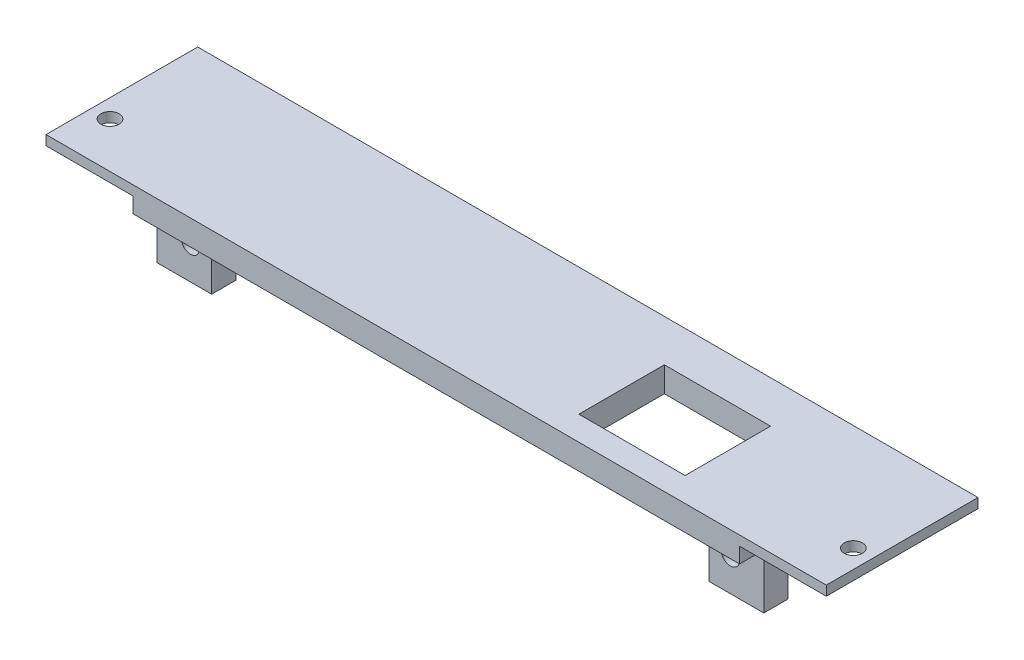
ISO-10303-21;
HEADER;
FILE_DESCRIPTION(('STEP AP214'),'2;1');
FILE_NAME('part.step','',(''),(''),'','','');
FILE_SCHEMA(('AUTOMOTIVE_DESIGN { 1 0 10303 214 1 1 1 1 }'));
ENDSEC;
DATA;
#1=APPLICATION_CONTEXT('core data for automotive mechanical design processes');
#2=APPLICATION_PROTOCOL_DEFINITION('international standard','automotive_design',2000,#1);
#3=PRODUCT_CONTEXT('',#1,'mechanical');
#4=PRODUCT('Part','Part','',(#3));
#5=PRODUCT_RELATED_PRODUCT_CATEGORY('part','',(#4));
#6=PRODUCT_DEFINITION_FORMATION('','',#4);
#7=PRODUCT_DEFINITION_CONTEXT('part definition',#1,'design');
#8=PRODUCT_DEFINITION('design','',#6,#7);
#9=PRODUCT_DEFINITION_SHAPE('','',#8);
#10=(LENGTH_UNIT() NAMED_UNIT(*) SI_UNIT(.MILLI.,.METRE.));
#11=(NAMED_UNIT(*) PLANE_ANGLE_UNIT() SI_UNIT($,.RADIAN.));
#12=(NAMED_UNIT(*) SI_UNIT($,.STERADIAN.) SOLID_ANGLE_UNIT());
#13=UNCERTAINTY_MEASURE_WITH_UNIT(LENGTH_MEASURE(1.E-05),#10,'distance_accuracy_value','');
#14=(GEOMETRIC_REPRESENTATION_CONTEXT(3) GLOBAL_UNCERTAINTY_ASSIGNED_CONTEXT((#13)) GLOBAL_UNIT_ASSIGNED_CONTEXT((#10,
#11,#12)) REPRESENTATION_CONTEXT('',''));
#15=CARTESIAN_POINT('',(0.,0.,0.));
#16=DIRECTION('',(0.,0.,1.));
#17=DIRECTION('',(1.,0.,0.));
#18=AXIS2_PLACEMENT_3D('',#15,#16,#17);
#19=CARTESIAN_POINT('',(0.,-2.54,0.));
#20=DIRECTION('',(0.,1.,0.));
#21=DIRECTION('',(0.,0.,1.));
#22=AXIS2_PLACEMENT_3D('',#19,#20,#21);
#23=PLANE('',#22);
#24=DIRECTION('',(-1.,0.,0.));
#25=VECTOR('',#24,1.);
#26=CARTESIAN_POINT('',(19.517706015329,-2.54,-5.59079221502232));
#27=LINE('',#26,#25);
#28=CARTESIAN_POINT('',(37.025706015329,-2.54,-5.59079221502232));
#29=VERTEX_POINT('',#28);
#30=CARTESIAN_POINT('',(19.517706015329,-2.54,-5.59079221502232));
#31=VERTEX_POINT('',#30);
#32=EDGE_CURVE('E261',#29,#31,#27,.T.);
#33=ORIENTED_EDGE('',*,*,#32,.T.);
#34=DIRECTION('',(0.,0.,1.));
#35=VECTOR('',#34,1.);
#36=CARTESIAN_POINT('',(19.517706015329,-2.54,-5.59079221502232));
#37=LINE('',#36,#35);
#38=CARTESIAN_POINT('',(19.517706015329,-2.54,8.49999999999975));
#39=VERTEX_POINT('',#38);
#40=EDGE_CURVE('E249',#31,#39,#37,.T.);
#41=ORIENTED_EDGE('',*,*,#40,.T.);
#42=DIRECTION('',(1.,0.,0.));
#43=VECTOR('',#42,1.);
#44=CARTESIAN_POINT('',(19.517706015329,-2.54,8.49999999999975));
#45=LINE('',#44,#43);
#46=CARTESIAN_POINT('',(37.025706015329,-2.54,8.49999999999975));
#47=VERTEX_POINT('',#46);
#48=EDGE_CURVE('E255',#39,#47,#45,.T.);
#49=ORIENTED_EDGE('',*,*,#48,.T.);
#50=DIRECTION('',(0.,0.,-1.));
#51=VECTOR('',#50,1.);
#52=CARTESIAN_POINT('',(37.025706015329,-2.54,-5.59079221502232));
#53=LINE('',#52,#51);
#54=EDGE_CURVE('E258',#47,#29,#53,.T.);
#55=ORIENTED_EDGE('',*,*,#54,.T.);
#56=EDGE_LOOP('',(#33,#41,#49,#55));
#57=FACE_BOUND('',#56,.T.);
#58=DIRECTION('',(0.,0.,1.));
#59=VECTOR('',#58,1.);
#60=CARTESIAN_POINT('',(-41.,-2.54,4.5));
#61=LINE('',#60,#59);
#62=CARTESIAN_POINT('',(-41.,-2.54,2.5));
#63=VERTEX_POINT('',#62);
#64=CARTESIAN_POINT('',(-41.,-2.54,8.5));
#65=VERTEX_POINT('',#64);
#66=EDGE_CURVE('E247',#63,#65,#61,.T.);
#67=ORIENTED_EDGE('',*,*,#66,.F.);
#68=DIRECTION('',(-1.,0.,0.));
#69=VECTOR('',#68,1.);
#70=CARTESIAN_POINT('',(-50.,-2.54,2.5));
#71=LINE('',#70,#69);
#72=CARTESIAN_POINT('',(-50.,-2.54,2.5));
#73=VERTEX_POINT('',#72);
#74=EDGE_CURVE('E358',#63,#73,#71,.T.);
#75=ORIENTED_EDGE('',*,*,#74,.T.);
#76=DIRECTION('',(0.,0.,1.));
#77=VECTOR('',#76,1.);
#78=CARTESIAN_POINT('',(-50.,-2.54,-12.5));
#79=LINE('',#78,#77);
#80=CARTESIAN_POINT('',(-50.,-2.54,-12.5));
#81=VERTEX_POINT('',#80);
#82=EDGE_CURVE('E265',#81,#73,#79,.T.);
#83=ORIENTED_EDGE('',*,*,#82,.F.);
#84=DIRECTION('',(-1.,0.,0.));
#85=VECTOR('',#84,1.);
#86=CARTESIAN_POINT('',(-50.,-2.54,-12.5));
#87=LINE('',#86,#85);
#88=CARTESIAN_POINT('',(50.,-2.54,-12.5));
#89=VERTEX_POINT('',#88);
#90=EDGE_CURVE('E276',#89,#81,#87,.T.);
#91=ORIENTED_EDGE('',*,*,#90,.F.);
#92=DIRECTION('',(0.,0.,-1.));
#93=VECTOR('',#92,1.);
#94=CARTESIAN_POINT('',(50.,-2.54,-12.5));
#95=LINE('',#94,#93);
#96=CARTESIAN_POINT('',(50.,-2.54,2.5));
#97=VERTEX_POINT('',#96);
#98=EDGE_CURVE('E272',#97,#89,#95,.T.);
#99=ORIENTED_EDGE('',*,*,#98,.F.);
#100=DIRECTION('',(-1.,0.,0.));
#101=VECTOR('',#100,1.);
#102=CARTESIAN_POINT('',(0.,-2.54,2.5));
#103=LINE('',#102,#101);
#104=CARTESIAN_POINT('',(41.,-2.54,2.5));
#105=VERTEX_POINT('',#104);
#106=EDGE_CURVE('E355',#97,#105,#103,.T.);
#107=ORIENTED_EDGE('',*,*,#106,.T.);
#108=DIRECTION('',(0.,0.,1.));
#109=VECTOR('',#108,1.);
#110=CARTESIAN_POINT('',(41.,-2.54,4.5));
#111=LINE('',#110,#109);
#112=CARTESIAN_POINT('',(41.,-2.54,8.5));
#113=VERTEX_POINT('',#112);
#114=EDGE_CURVE('E202',#105,#113,#111,.T.);
#115=ORIENTED_EDGE('',*,*,#114,.T.);
#116=DIRECTION('',(-1.,0.,0.));
#117=VECTOR('',#116,1.);
#118=CARTESIAN_POINT('',(50.,-2.54,8.5));
#119=LINE('',#118,#117);
#120=CARTESIAN_POINT('',(50.,-2.54,8.5));
#121=VERTEX_POINT('',#120);
#122=EDGE_CURVE('E212',#121,#113,#119,.T.);
#123=ORIENTED_EDGE('',*,*,#122,.F.);
#124=CARTESIAN_POINT('',(50.,-2.54,12.5));
#125=VERTEX_POINT('',#124);
#126=EDGE_CURVE('E273',#125,#121,#95,.T.);
#127=ORIENTED_EDGE('',*,*,#126,.F.);
#128=DIRECTION('',(1.,0.,0.));
#129=VECTOR('',#128,1.);
#130=CARTESIAN_POINT('',(-50.,-2.54,12.5));
#131=LINE('',#130,#129);
#132=CARTESIAN_POINT('',(-50.,-2.54,12.5));
#133=VERTEX_POINT('',#132);
#134=EDGE_CURVE('E268',#133,#125,#131,.T.);
#135=ORIENTED_EDGE('',*,*,#134,.F.);
#136=CARTESIAN_POINT('',(-50.,-2.54,8.5));
#137=VERTEX_POINT('',#136);
#138=EDGE_CURVE('E269',#137,#133,#79,.T.);
#139=ORIENTED_EDGE('',*,*,#138,.F.);
#140=DIRECTION('',(-1.,0.,0.));
#141=VECTOR('',#140,1.);
#142=CARTESIAN_POINT('',(-50.,-2.54,8.5));
#143=LINE('',#142,#141);
#144=EDGE_CURVE('E230',#65,#137,#143,.T.);
#145=ORIENTED_EDGE('',*,*,#144,.F.);
#146=EDGE_LOOP('',(#67,#75,#83,#91,#99,#107,#115,#123,#127,#135,#139,#145));
#147=FACE_BOUND('',#146,.T.);
#148=ADVANCED_FACE('F41',(#57,#147),#23,.F.);
#149=CARTESIAN_POINT('',(0.,0.,0.));
#150=DIRECTION('',(0.,1.,0.));
#151=DIRECTION('',(0.,0.,1.));
#152=AXIS2_PLACEMENT_3D('',#149,#150,#151);
#153=PLANE('',#152);
#154=CARTESIAN_POINT('',(-61.25,0.,5.));
#155=DIRECTION('',(0.,1.,0.));
#156=DIRECTION('',(0.,0.,1.));
#157=AXIS2_PLACEMENT_3D('',#154,#155,#156);
#158=CIRCLE('',#157,1.5);
#159=CARTESIAN_POINT('',(-61.25,0.,6.50000000000001));
#160=VERTEX_POINT('',#159);
#161=EDGE_CURVE('E313',#160,#160,#158,.T.);
#162=ORIENTED_EDGE('',*,*,#161,.T.);
#163=EDGE_LOOP('',(#162));
#164=FACE_BOUND('',#163,.T.);
#165=DIRECTION('',(-1.,0.,0.));
#166=VECTOR('',#165,1.);
#167=CARTESIAN_POINT('',(-64.3,0.,-12.5));
#168=LINE('',#167,#166);
#169=CARTESIAN_POINT('',(-50.,0.,-12.5));
#170=VERTEX_POINT('',#169);
#171=CARTESIAN_POINT('',(-64.3,0.,-12.5));
#172=VERTEX_POINT('',#171);
#173=EDGE_CURVE('E335',#170,#172,#168,.T.);
#174=ORIENTED_EDGE('',*,*,#173,.F.);
#175=DIRECTION('',(0.,0.,1.));
#176=VECTOR('',#175,1.);
#177=CARTESIAN_POINT('',(-50.,0.,-12.5));
#178=LINE('',#177,#176);
#179=CARTESIAN_POINT('',(-50.,0.,12.5));
#180=VERTEX_POINT('',#179);
#181=EDGE_CURVE('E264',#170,#180,#178,.T.);
#182=ORIENTED_EDGE('',*,*,#181,.T.);
#183=DIRECTION('',(1.,0.,0.));
#184=VECTOR('',#183,1.);
#185=CARTESIAN_POINT('',(-64.3,0.,12.5));
#186=LINE('',#185,#184);
#187=CARTESIAN_POINT('',(-64.3,0.,12.5));
#188=VERTEX_POINT('',#187);
#189=EDGE_CURVE('E326',#188,#180,#186,.T.);
#190=ORIENTED_EDGE('',*,*,#189,.F.);
#191=DIRECTION('',(0.,0.,1.));
#192=VECTOR('',#191,1.);
#193=CARTESIAN_POINT('',(-64.3,0.,-12.5));
#194=LINE('',#193,#192);
#195=EDGE_CURVE('E339',#172,#188,#194,.T.);
#196=ORIENTED_EDGE('',*,*,#195,.F.);
#197=EDGE_LOOP('',(#174,#182,#190,#196));
#198=FACE_BOUND('',#197,.T.);
#199=ADVANCED_FACE('F447',(#164,#198),#153,.F.);
#200=CARTESIAN_POINT('',(0.,1.6,0.));
#201=DIRECTION('',(0.,1.,0.));
#202=DIRECTION('',(0.,0.,1.));
#203=AXIS2_PLACEMENT_3D('',#200,#201,#202);
#204=PLANE('',#203);
#205=CARTESIAN_POINT('',(-61.25,1.6,5.));
#206=DIRECTION('',(0.,1.,0.));
#207=DIRECTION('',(0.,0.,1.));
#208=AXIS2_PLACEMENT_3D('',#205,#206,#207);
#209=CIRCLE('',#208,1.5);
#210=CARTESIAN_POINT('',(-61.25,1.6,6.50000000000001));
#211=VERTEX_POINT('',#210);
#212=EDGE_CURVE('E316',#211,#211,#209,.T.);
#213=ORIENTED_EDGE('',*,*,#212,.F.);
#214=EDGE_LOOP('',(#213));
#215=FACE_BOUND('',#214,.T.);
#216=DIRECTION('',(0.,0.,-1.));
#217=VECTOR('',#216,1.);
#218=CARTESIAN_POINT('',(64.3,1.6,-12.5));
#219=LINE('',#218,#217);
#220=CARTESIAN_POINT('',(64.3,1.6,12.5));
#221=VERTEX_POINT('',#220);
#222=CARTESIAN_POINT('',(64.3,1.6,-12.5));
#223=VERTEX_POINT('',#222);
#224=EDGE_CURVE('E322',#221,#223,#219,.T.);
#225=ORIENTED_EDGE('',*,*,#224,.T.);
#226=DIRECTION('',(-1.,0.,0.));
#227=VECTOR('',#226,1.);
#228=CARTESIAN_POINT('',(-64.3,1.6,-12.5));
#229=LINE('',#228,#227);
#230=CARTESIAN_POINT('',(-64.3,1.6,-12.5));
#231=VERTEX_POINT('',#230);
#232=EDGE_CURVE('E325',#223,#231,#229,.T.);
#233=ORIENTED_EDGE('',*,*,#232,.T.);
#234=DIRECTION('',(0.,0.,1.));
#235=VECTOR('',#234,1.);
#236=CARTESIAN_POINT('',(-64.3,1.6,-12.5));
#237=LINE('',#236,#235);
#238=CARTESIAN_POINT('',(-64.3,1.6,12.5));
#239=VERTEX_POINT('',#238);
#240=EDGE_CURVE('E328',#231,#239,#237,.T.);
#241=ORIENTED_EDGE('',*,*,#240,.T.);
#242=DIRECTION('',(1.,0.,0.));
#243=VECTOR('',#242,1.);
#244=CARTESIAN_POINT('',(-64.3,1.6,12.5));
#245=LINE('',#244,#243);
#246=EDGE_CURVE('E330',#239,#221,#245,.T.);
#247=ORIENTED_EDGE('',*,*,#246,.T.);
#248=EDGE_LOOP('',(#225,#233,#241,#247));
#249=FACE_BOUND('',#248,.T.);
#250=CARTESIAN_POINT('',(61.25,1.6,5.));
#251=DIRECTION('',(0.,1.,0.));
#252=DIRECTION('',(0.,0.,1.));
#253=AXIS2_PLACEMENT_3D('',#250,#251,#252);
#254=CIRCLE('',#253,1.5);
#255=CARTESIAN_POINT('',(61.25,1.6,6.5));
#256=VERTEX_POINT('',#255);
#257=EDGE_CURVE('E310',#256,#256,#254,.T.);
#258=ORIENTED_EDGE('',*,*,#257,.F.);
#259=EDGE_LOOP('',(#258));
#260=FACE_BOUND('',#259,.T.);
#261=DIRECTION('',(1.,0.,0.));
#262=VECTOR('',#261,1.);
#263=CARTESIAN_POINT('',(19.517706015329,1.6,8.49999999999975));
#264=LINE('',#263,#262);
#265=CARTESIAN_POINT('',(19.517706015329,1.6,8.49999999999975));
#266=VERTEX_POINT('',#265);
#267=CARTESIAN_POINT('',(37.025706015329,1.6,8.49999999999975));
#268=VERTEX_POINT('',#267);
#269=EDGE_CURVE('E294',#266,#268,#264,.T.);
#270=ORIENTED_EDGE('',*,*,#269,.F.);
#271=DIRECTION('',(0.,0.,1.));
#272=VECTOR('',#271,1.);
#273=CARTESIAN_POINT('',(19.517706015329,1.6,8.49999999999975));
#274=LINE('',#273,#272);
#275=CARTESIAN_POINT('',(19.517706015329,1.6,-5.59079221502232));
#276=VERTEX_POINT('',#275);
#277=EDGE_CURVE('E287',#276,#266,#274,.T.);
#278=ORIENTED_EDGE('',*,*,#277,.F.);
#279=DIRECTION('',(-1.,0.,0.));
#280=VECTOR('',#279,1.);
#281=CARTESIAN_POINT('',(19.517706015329,1.6,-5.59079221502232));
#282=LINE('',#281,#280);
#283=CARTESIAN_POINT('',(37.025706015329,1.6,-5.59079221502232));
#284=VERTEX_POINT('',#283);
#285=EDGE_CURVE('E299',#284,#276,#282,.T.);
#286=ORIENTED_EDGE('',*,*,#285,.F.);
#287=DIRECTION('',(0.,0.,-1.));
#288=VECTOR('',#287,1.);
#289=CARTESIAN_POINT('',(37.025706015329,1.6,8.49999999999975));
#290=LINE('',#289,#288);
#291=EDGE_CURVE('E296',#268,#284,#290,.T.);
#292=ORIENTED_EDGE('',*,*,#291,.F.);
#293=EDGE_LOOP('',(#270,#278,#286,#292));
#294=FACE_BOUND('',#293,.T.);
#295=ADVANCED_FACE('F453',(#215,#249,#260,#294),#204,.T.);
#296=CARTESIAN_POINT('',(61.25,0.,5.));
#297=DIRECTION('',(0.,1.,0.));
#298=DIRECTION('',(0.,0.,1.));
#299=AXIS2_PLACEMENT_3D('',#296,#297,#298);
#300=CIRCLE('',#299,1.5);
#301=CARTESIAN_POINT('',(61.25,0.,6.5));
#302=VERTEX_POINT('',#301);
#303=EDGE_CURVE('E309',#302,#302,#300,.T.);
#304=ORIENTED_EDGE('',*,*,#303,.T.);
#305=EDGE_LOOP('',(#304));
#306=FACE_BOUND('',#305,.T.);
#307=CARTESIAN_POINT('',(50.,0.,12.5));
#308=VERTEX_POINT('',#307);
#309=CARTESIAN_POINT('',(64.3,0.,12.5));
#310=VERTEX_POINT('',#309);
#311=EDGE_CURVE('E341',#308,#310,#186,.T.);
#312=ORIENTED_EDGE('',*,*,#311,.F.);
#313=DIRECTION('',(0.,0.,-1.));
#314=VECTOR('',#313,1.);
#315=CARTESIAN_POINT('',(50.,0.,-12.5));
#316=LINE('',#315,#314);
#317=CARTESIAN_POINT('',(50.,0.,-12.5));
#318=VERTEX_POINT('',#317);
#319=EDGE_CURVE('E282',#308,#318,#316,.T.);
#320=ORIENTED_EDGE('',*,*,#319,.T.);
#321=CARTESIAN_POINT('',(64.3,0.,-12.5));
#322=VERTEX_POINT('',#321);
#323=EDGE_CURVE('E336',#322,#318,#168,.T.);
#324=ORIENTED_EDGE('',*,*,#323,.F.);
#325=DIRECTION('',(0.,0.,-1.));
#326=VECTOR('',#325,1.);
#327=CARTESIAN_POINT('',(64.3,0.,-12.5));
#328=LINE('',#327,#326);
#329=EDGE_CURVE('E319',#310,#322,#328,.T.);
#330=ORIENTED_EDGE('',*,*,#329,.F.);
#331=EDGE_LOOP('',(#312,#320,#324,#330));
#332=FACE_BOUND('',#331,.T.);
#333=ADVANCED_FACE('F456',(#306,#332),#153,.F.);
#334=CARTESIAN_POINT('',(64.3,1.6,-12.5));
#335=DIRECTION('',(-1.,0.,0.));
#336=DIRECTION('',(0.,0.,1.));
#337=AXIS2_PLACEMENT_3D('',#334,#335,#336);
#338=PLANE('',#337);
#339=ORIENTED_EDGE('',*,*,#329,.T.);
#340=DIRECTION('',(0.,-1.,0.));
#341=VECTOR('',#340,1.);
#342=CARTESIAN_POINT('',(64.3,1.6,-12.5));
#343=LINE('',#342,#341);
#344=EDGE_CURVE('E352',#223,#322,#343,.T.);
#345=ORIENTED_EDGE('',*,*,#344,.F.);
#346=ORIENTED_EDGE('',*,*,#224,.F.);
#347=DIRECTION('',(0.,-1.,0.));
#348=VECTOR('',#347,1.);
#349=CARTESIAN_POINT('',(64.3,1.6,12.5));
#350=LINE('',#349,#348);
#351=EDGE_CURVE('E332',#221,#310,#350,.T.);
#352=ORIENTED_EDGE('',*,*,#351,.T.);
#353=EDGE_LOOP('',(#339,#345,#346,#352));
#354=FACE_BOUND('',#353,.T.);
#355=ADVANCED_FACE('F488',(#354),#338,.F.);
#356=CARTESIAN_POINT('',(-64.3,1.6,-12.5));
#357=DIRECTION('',(0.,0.,1.));
#358=DIRECTION('',(1.,0.,0.));
#359=AXIS2_PLACEMENT_3D('',#356,#357,#358);
#360=PLANE('',#359);
#361=ORIENTED_EDGE('',*,*,#323,.T.);
#362=DIRECTION('',(0.,1.,0.));
#363=VECTOR('',#362,1.);
#364=CARTESIAN_POINT('',(50.,-2.54,-12.5));
#365=LINE('',#364,#363);
#366=EDGE_CURVE('E288',#89,#318,#365,.T.);
#367=ORIENTED_EDGE('',*,*,#366,.F.);
#368=ORIENTED_EDGE('',*,*,#90,.T.);
#369=DIRECTION('',(0.,1.,0.));
#370=VECTOR('',#369,1.);
#371=CARTESIAN_POINT('',(-50.,-2.54,-12.5));
#372=LINE('',#371,#370);
#373=EDGE_CURVE('E285',#81,#170,#372,.T.);
#374=ORIENTED_EDGE('',*,*,#373,.T.);
#375=ORIENTED_EDGE('',*,*,#173,.T.);
#376=DIRECTION('',(0.,-1.,0.));
#377=VECTOR('',#376,1.);
#378=CARTESIAN_POINT('',(-64.3,1.6,-12.5));
#379=LINE('',#378,#377);
#380=EDGE_CURVE('E349',#231,#172,#379,.T.);
#381=ORIENTED_EDGE('',*,*,#380,.F.);
#382=ORIENTED_EDGE('',*,*,#232,.F.);
#383=ORIENTED_EDGE('',*,*,#344,.T.);
#384=EDGE_LOOP('',(#361,#367,#368,#374,#375,#381,#382,#383));
#385=FACE_BOUND('',#384,.T.);
#386=ADVANCED_FACE('F387',(#385),#360,.F.);
#387=CARTESIAN_POINT('',(-64.3,1.6,-12.5));
#388=DIRECTION('',(1.,0.,0.));
#389=DIRECTION('',(0.,0.,-1.));
#390=AXIS2_PLACEMENT_3D('',#387,#388,#389);
#391=PLANE('',#390);
#392=ORIENTED_EDGE('',*,*,#195,.T.);
#393=DIRECTION('',(0.,-1.,0.));
#394=VECTOR('',#393,1.);
#395=CARTESIAN_POINT('',(-64.3,1.6,12.5));
#396=LINE('',#395,#394);
#397=EDGE_CURVE('E346',#239,#188,#396,.T.);
#398=ORIENTED_EDGE('',*,*,#397,.F.);
#399=ORIENTED_EDGE('',*,*,#240,.F.);
#400=ORIENTED_EDGE('',*,*,#380,.T.);
#401=EDGE_LOOP('',(#392,#398,#399,#400));
#402=FACE_BOUND('',#401,.T.);
#403=ADVANCED_FACE('F492',(#402),#391,.F.);
#404=CARTESIAN_POINT('',(-64.3,1.6,12.5));
#405=DIRECTION('',(0.,0.,-1.));
#406=DIRECTION('',(-1.,0.,0.));
#407=AXIS2_PLACEMENT_3D('',#404,#405,#406);
#408=PLANE('',#407);
#409=ORIENTED_EDGE('',*,*,#189,.T.);
#410=DIRECTION('',(0.,1.,0.));
#411=VECTOR('',#410,1.);
#412=CARTESIAN_POINT('',(-50.,-2.54,12.5));
#413=LINE('',#412,#411);
#414=EDGE_CURVE('E279',#133,#180,#413,.T.);
#415=ORIENTED_EDGE('',*,*,#414,.F.);
#416=ORIENTED_EDGE('',*,*,#134,.T.);
#417=DIRECTION('',(0.,1.,0.));
#418=VECTOR('',#417,1.);
#419=CARTESIAN_POINT('',(50.,-2.54,12.5));
#420=LINE('',#419,#418);
#421=EDGE_CURVE('E290',#125,#308,#420,.T.);
#422=ORIENTED_EDGE('',*,*,#421,.T.);
#423=ORIENTED_EDGE('',*,*,#311,.T.);
#424=ORIENTED_EDGE('',*,*,#351,.F.);
#425=ORIENTED_EDGE('',*,*,#246,.F.);
#426=ORIENTED_EDGE('',*,*,#397,.T.);
#427=EDGE_LOOP('',(#409,#415,#416,#422,#423,#424,#425,#426));
#428=FACE_BOUND('',#427,.T.);
#429=ADVANCED_FACE('F421',(#428),#408,.F.);
#430=CARTESIAN_POINT('',(-61.25,1.6,5.));
#431=DIRECTION('',(0.,-1.,0.));
#432=DIRECTION('',(0.,0.,-1.));
#433=AXIS2_PLACEMENT_3D('',#430,#431,#432);
#434=CYLINDRICAL_SURFACE('',#433,1.5);
#435=ORIENTED_EDGE('',*,*,#212,.T.);
#436=EDGE_LOOP('',(#435));
#437=FACE_BOUND('',#436,.T.);
#438=ORIENTED_EDGE('',*,*,#161,.F.);
#439=EDGE_LOOP('',(#438));
#440=FACE_BOUND('',#439,.T.);
#441=ADVANCED_FACE('F479',(#437,#440),#434,.F.);
#442=CARTESIAN_POINT('',(61.25,1.6,5.));
#443=DIRECTION('',(0.,-1.,0.));
#444=DIRECTION('',(0.,0.,-1.));
#445=AXIS2_PLACEMENT_3D('',#442,#443,#444);
#446=CYLINDRICAL_SURFACE('',#445,1.5);
#447=ORIENTED_EDGE('',*,*,#257,.T.);
#448=EDGE_LOOP('',(#447));
#449=FACE_BOUND('',#448,.T.);
#450=ORIENTED_EDGE('',*,*,#303,.F.);
#451=EDGE_LOOP('',(#450));
#452=FACE_BOUND('',#451,.T.);
#453=ADVANCED_FACE('F475',(#449,#452),#446,.F.);
#454=CARTESIAN_POINT('',(19.517706015329,1.6,8.49999999999975));
#455=DIRECTION('',(1.,0.,0.));
#456=DIRECTION('',(0.,0.,-1.));
#457=AXIS2_PLACEMENT_3D('',#454,#455,#456);
#458=PLANE('',#457);
#459=DIRECTION('',(0.,-1.,0.));
#460=VECTOR('',#459,1.);
#461=CARTESIAN_POINT('',(19.517706015329,1.6,8.49999999999975));
#462=LINE('',#461,#460);
#463=EDGE_CURVE('E307',#266,#39,#462,.T.);
#464=ORIENTED_EDGE('',*,*,#463,.T.);
#465=ORIENTED_EDGE('',*,*,#40,.F.);
#466=DIRECTION('',(0.,-1.,0.));
#467=VECTOR('',#466,1.);
#468=CARTESIAN_POINT('',(19.517706015329,1.6,-5.59079221502232));
#469=LINE('',#468,#467);
#470=EDGE_CURVE('E301',#276,#31,#469,.T.);
#471=ORIENTED_EDGE('',*,*,#470,.F.);
#472=ORIENTED_EDGE('',*,*,#277,.T.);
#473=EDGE_LOOP('',(#464,#465,#471,#472));
#474=FACE_BOUND('',#473,.T.);
#475=ADVANCED_FACE('F471',(#474),#458,.T.);
#476=CARTESIAN_POINT('',(19.517706015329,1.6,8.49999999999975));
#477=DIRECTION('',(0.,0.,-1.));
#478=DIRECTION('',(-1.,0.,0.));
#479=AXIS2_PLACEMENT_3D('',#476,#477,#478);
#480=PLANE('',#479);
#481=DIRECTION('',(0.,-1.,0.));
#482=VECTOR('',#481,1.);
#483=CARTESIAN_POINT('',(37.025706015329,1.6,8.49999999999975));
#484=LINE('',#483,#482);
#485=EDGE_CURVE('E305',#268,#47,#484,.T.);
#486=ORIENTED_EDGE('',*,*,#485,.T.);
#487=ORIENTED_EDGE('',*,*,#48,.F.);
#488=ORIENTED_EDGE('',*,*,#463,.F.);
#489=ORIENTED_EDGE('',*,*,#269,.T.);
#490=EDGE_LOOP('',(#486,#487,#488,#489));
#491=FACE_BOUND('',#490,.T.);
#492=ADVANCED_FACE('F467',(#491),#480,.T.);
#493=CARTESIAN_POINT('',(37.025706015329,1.6,8.49999999999975));
#494=DIRECTION('',(-1.,0.,0.));
#495=DIRECTION('',(0.,0.,1.));
#496=AXIS2_PLACEMENT_3D('',#493,#494,#495);
#497=PLANE('',#496);
#498=DIRECTION('',(0.,-1.,0.));
#499=VECTOR('',#498,1.);
#500=CARTESIAN_POINT('',(37.025706015329,1.6,-5.59079221502232));
#501=LINE('',#500,#499);
#502=EDGE_CURVE('E303',#284,#29,#501,.T.);
#503=ORIENTED_EDGE('',*,*,#502,.T.);
#504=ORIENTED_EDGE('',*,*,#54,.F.);
#505=ORIENTED_EDGE('',*,*,#485,.F.);
#506=ORIENTED_EDGE('',*,*,#291,.T.);
#507=EDGE_LOOP('',(#503,#504,#505,#506));
#508=FACE_BOUND('',#507,.T.);
#509=ADVANCED_FACE('F463',(#508),#497,.T.);
#510=CARTESIAN_POINT('',(19.517706015329,1.6,-5.59079221502232));
#511=DIRECTION('',(0.,0.,1.));
#512=DIRECTION('',(1.,0.,0.));
#513=AXIS2_PLACEMENT_3D('',#510,#511,#512);
#514=PLANE('',#513);
#515=ORIENTED_EDGE('',*,*,#470,.T.);
#516=ORIENTED_EDGE('',*,*,#32,.F.);
#517=ORIENTED_EDGE('',*,*,#502,.F.);
#518=ORIENTED_EDGE('',*,*,#285,.T.);
#519=EDGE_LOOP('',(#515,#516,#517,#518));
#520=FACE_BOUND('',#519,.T.);
#521=ADVANCED_FACE('F461',(#520),#514,.T.);
#522=CARTESIAN_POINT('',(-50.,-2.54,-12.5));
#523=DIRECTION('',(-1.,0.,0.));
#524=DIRECTION('',(0.,0.,1.));
#525=AXIS2_PLACEMENT_3D('',#522,#523,#524);
#526=PLANE('',#525);
#527=ORIENTED_EDGE('',*,*,#181,.F.);
#528=ORIENTED_EDGE('',*,*,#373,.F.);
#529=ORIENTED_EDGE('',*,*,#82,.T.);
#530=CARTESIAN_POINT('',(-50.,-4.54,2.5));
#531=DIRECTION('',(-1.,0.,0.));
#532=DIRECTION('',(0.,0.,1.));
#533=AXIS2_PLACEMENT_3D('',#530,#531,#532);
#534=CIRCLE('',#533,2.);
#535=CARTESIAN_POINT('',(-50.,-4.54,4.5));
#536=VERTEX_POINT('',#535);
#537=EDGE_CURVE('E364',#73,#536,#534,.F.);
#538=ORIENTED_EDGE('',*,*,#537,.T.);
#539=DIRECTION('',(0.,-1.,0.));
#540=VECTOR('',#539,1.);
#541=CARTESIAN_POINT('',(-50.,-2.54,4.5));
#542=LINE('',#541,#540);
#543=CARTESIAN_POINT('',(-50.,-11.54,4.5));
#544=VERTEX_POINT('',#543);
#545=EDGE_CURVE('E227',#536,#544,#542,.T.);
#546=ORIENTED_EDGE('',*,*,#545,.T.);
#547=DIRECTION('',(0.,0.,1.));
#548=VECTOR('',#547,1.);
#549=CARTESIAN_POINT('',(-50.,-11.54,4.5));
#550=LINE('',#549,#548);
#551=CARTESIAN_POINT('',(-50.,-11.54,8.5));
#552=VERTEX_POINT('',#551);
#553=EDGE_CURVE('E236',#544,#552,#550,.T.);
#554=ORIENTED_EDGE('',*,*,#553,.T.);
#555=DIRECTION('',(0.,-1.,0.));
#556=VECTOR('',#555,1.);
#557=CARTESIAN_POINT('',(-50.,-2.54,8.5));
#558=LINE('',#557,#556);
#559=EDGE_CURVE('E224',#137,#552,#558,.T.);
#560=ORIENTED_EDGE('',*,*,#559,.F.);
#561=ORIENTED_EDGE('',*,*,#138,.T.);
#562=ORIENTED_EDGE('',*,*,#414,.T.);
#563=EDGE_LOOP('',(#527,#528,#529,#538,#546,#554,#560,#561,#562));
#564=FACE_BOUND('',#563,.T.);
#565=ADVANCED_FACE('F383',(#564),#526,.T.);
#566=CARTESIAN_POINT('',(50.,-2.54,-12.5));
#567=DIRECTION('',(1.,0.,0.));
#568=DIRECTION('',(0.,0.,-1.));
#569=AXIS2_PLACEMENT_3D('',#566,#567,#568);
#570=PLANE('',#569);
#571=ORIENTED_EDGE('',*,*,#319,.F.);
#572=ORIENTED_EDGE('',*,*,#421,.F.);
#573=ORIENTED_EDGE('',*,*,#126,.T.);
#574=DIRECTION('',(0.,1.,0.));
#575=VECTOR('',#574,1.);
#576=CARTESIAN_POINT('',(50.,-2.54,8.5));
#577=LINE('',#576,#575);
#578=CARTESIAN_POINT('',(50.,-11.54,8.5));
#579=VERTEX_POINT('',#578);
#580=EDGE_CURVE('E210',#579,#121,#577,.T.);
#581=ORIENTED_EDGE('',*,*,#580,.F.);
#582=DIRECTION('',(0.,0.,1.));
#583=VECTOR('',#582,1.);
#584=CARTESIAN_POINT('',(50.,-11.54,4.5));
#585=LINE('',#584,#583);
#586=CARTESIAN_POINT('',(50.,-11.54,4.5));
#587=VERTEX_POINT('',#586);
#588=EDGE_CURVE('E201',#587,#579,#585,.T.);
#589=ORIENTED_EDGE('',*,*,#588,.F.);
#590=DIRECTION('',(0.,1.,0.));
#591=VECTOR('',#590,1.);
#592=CARTESIAN_POINT('',(50.,-2.54,4.5));
#593=LINE('',#592,#591);
#594=CARTESIAN_POINT('',(50.,-4.54,4.5));
#595=VERTEX_POINT('',#594);
#596=EDGE_CURVE('E193',#587,#595,#593,.T.);
#597=ORIENTED_EDGE('',*,*,#596,.T.);
#598=CARTESIAN_POINT('',(50.,-4.54,2.5));
#599=DIRECTION('',(1.,0.,0.));
#600=DIRECTION('',(0.,0.,-1.));
#601=AXIS2_PLACEMENT_3D('',#598,#599,#600);
#602=CIRCLE('',#601,2.);
#603=EDGE_CURVE('E11',#595,#97,#602,.F.);
#604=ORIENTED_EDGE('',*,*,#603,.T.);
#605=ORIENTED_EDGE('',*,*,#98,.T.);
#606=ORIENTED_EDGE('',*,*,#366,.T.);
#607=EDGE_LOOP('',(#571,#572,#573,#581,#589,#597,#604,#605,#606));
#608=FACE_BOUND('',#607,.T.);
#609=ADVANCED_FACE('F396',(#608),#570,.T.);
#610=CARTESIAN_POINT('',(-41.,-2.54,4.5));
#611=DIRECTION('',(1.,0.,0.));
#612=DIRECTION('',(0.,0.,-1.));
#613=AXIS2_PLACEMENT_3D('',#610,#611,#612);
#614=PLANE('',#613);
#615=DIRECTION('',(0.,1.,0.));
#616=VECTOR('',#615,1.);
#617=CARTESIAN_POINT('',(-41.,-2.54,8.5));
#618=LINE('',#617,#616);
#619=CARTESIAN_POINT('',(-41.,-11.54,8.5));
#620=VERTEX_POINT('',#619);
#621=EDGE_CURVE('E242',#620,#65,#618,.T.);
#622=ORIENTED_EDGE('',*,*,#621,.F.);
#623=DIRECTION('',(0.,0.,1.));
#624=VECTOR('',#623,1.);
#625=CARTESIAN_POINT('',(-41.,-11.54,4.5));
#626=LINE('',#625,#624);
#627=CARTESIAN_POINT('',(-41.,-11.54,4.5));
#628=VERTEX_POINT('',#627);
#629=EDGE_CURVE('E250',#628,#620,#626,.T.);
#630=ORIENTED_EDGE('',*,*,#629,.F.);
#631=DIRECTION('',(0.,1.,0.));
#632=VECTOR('',#631,1.);
#633=CARTESIAN_POINT('',(-41.,-2.54,4.5));
#634=LINE('',#633,#632);
#635=CARTESIAN_POINT('',(-41.,-4.54,4.5));
#636=VERTEX_POINT('',#635);
#637=EDGE_CURVE('E233',#628,#636,#634,.T.);
#638=ORIENTED_EDGE('',*,*,#637,.T.);
#639=CARTESIAN_POINT('',(-41.,-4.54,2.5));
#640=DIRECTION('',(1.,0.,0.));
#641=DIRECTION('',(0.,0.,-1.));
#642=AXIS2_PLACEMENT_3D('',#639,#640,#641);
#643=CIRCLE('',#642,2.);
#644=EDGE_CURVE('E366',#636,#63,#643,.F.);
#645=ORIENTED_EDGE('',*,*,#644,.T.);
#646=ORIENTED_EDGE('',*,*,#66,.T.);
#647=EDGE_LOOP('',(#622,#630,#638,#645,#646));
#648=FACE_BOUND('',#647,.T.);
#649=ADVANCED_FACE('F372',(#648),#614,.T.);
#650=CARTESIAN_POINT('',(-50.,-11.54,4.5));
#651=DIRECTION('',(0.,-1.,0.));
#652=DIRECTION('',(1.,0.,0.));
#653=AXIS2_PLACEMENT_3D('',#650,#651,#652);
#654=PLANE('',#653);
#655=DIRECTION('',(1.,0.,0.));
#656=VECTOR('',#655,1.);
#657=CARTESIAN_POINT('',(-50.,-11.54,8.5));
#658=LINE('',#657,#656);
#659=EDGE_CURVE('E239',#552,#620,#658,.T.);
#660=ORIENTED_EDGE('',*,*,#659,.F.);
#661=ORIENTED_EDGE('',*,*,#553,.F.);
#662=DIRECTION('',(1.,0.,0.));
#663=VECTOR('',#662,1.);
#664=CARTESIAN_POINT('',(-50.,-11.54,4.5));
#665=LINE('',#664,#663);
#666=EDGE_CURVE('E229',#544,#628,#665,.T.);
#667=ORIENTED_EDGE('',*,*,#666,.T.);
#668=ORIENTED_EDGE('',*,*,#629,.T.);
#669=EDGE_LOOP('',(#660,#661,#667,#668));
#670=FACE_BOUND('',#669,.T.);
#671=ADVANCED_FACE('F433',(#670),#654,.T.);
#672=CARTESIAN_POINT('',(0.,0.,4.5));
#673=DIRECTION('',(0.,0.,1.));
#674=DIRECTION('',(1.,0.,0.));
#675=AXIS2_PLACEMENT_3D('',#672,#673,#674);
#676=PLANE('',#675);
#677=CARTESIAN_POINT('',(-44.5,-6.08,4.5));
#678=DIRECTION('',(0.,0.,1.));
#679=DIRECTION('',(1.,0.,0.));
#680=AXIS2_PLACEMENT_3D('',#677,#678,#679);
#681=CIRCLE('',#680,1.5);
#682=CARTESIAN_POINT('',(-43.,-6.08,4.5));
#683=VERTEX_POINT('',#682);
#684=EDGE_CURVE('E221',#683,#683,#681,.T.);
#685=ORIENTED_EDGE('',*,*,#684,.T.);
#686=EDGE_LOOP('',(#685));
#687=FACE_BOUND('',#686,.T.);
#688=ORIENTED_EDGE('',*,*,#545,.F.);
#689=DIRECTION('',(-1.,0.,0.));
#690=VECTOR('',#689,1.);
#691=CARTESIAN_POINT('',(-41.,-4.54,4.5));
#692=LINE('',#691,#690);
#693=EDGE_CURVE('E361',#536,#636,#692,.F.);
#694=ORIENTED_EDGE('',*,*,#693,.T.);
#695=ORIENTED_EDGE('',*,*,#637,.F.);
#696=ORIENTED_EDGE('',*,*,#666,.F.);
#697=EDGE_LOOP('',(#688,#694,#695,#696));
#698=FACE_BOUND('',#697,.T.);
#699=ADVANCED_FACE('F432',(#687,#698),#676,.F.);
#700=CARTESIAN_POINT('',(0.,0.,8.5));
#701=DIRECTION('',(0.,0.,1.));
#702=DIRECTION('',(1.,0.,0.));
#703=AXIS2_PLACEMENT_3D('',#700,#701,#702);
#704=PLANE('',#703);
#705=CARTESIAN_POINT('',(-44.5,-6.08,8.5));
#706=DIRECTION('',(0.,0.,1.));
#707=DIRECTION('',(1.,0.,0.));
#708=AXIS2_PLACEMENT_3D('',#705,#706,#707);
#709=CIRCLE('',#708,1.5);
#710=CARTESIAN_POINT('',(-43.,-6.08,8.5));
#711=VERTEX_POINT('',#710);
#712=EDGE_CURVE('E219',#711,#711,#709,.T.);
#713=ORIENTED_EDGE('',*,*,#712,.F.);
#714=EDGE_LOOP('',(#713));
#715=FACE_BOUND('',#714,.T.);
#716=ORIENTED_EDGE('',*,*,#559,.T.);
#717=ORIENTED_EDGE('',*,*,#659,.T.);
#718=ORIENTED_EDGE('',*,*,#621,.T.);
#719=ORIENTED_EDGE('',*,*,#144,.T.);
#720=EDGE_LOOP('',(#716,#717,#718,#719));
#721=FACE_BOUND('',#720,.T.);
#722=ADVANCED_FACE('F428',(#715,#721),#704,.T.);
#723=CARTESIAN_POINT('',(-44.5,-6.08,4.5));
#724=DIRECTION('',(0.,0.,1.));
#725=DIRECTION('',(1.,0.,0.));
#726=AXIS2_PLACEMENT_3D('',#723,#724,#725);
#727=CYLINDRICAL_SURFACE('',#726,1.5);
#728=ORIENTED_EDGE('',*,*,#684,.F.);
#729=EDGE_LOOP('',(#728));
#730=FACE_BOUND('',#729,.T.);
#731=ORIENTED_EDGE('',*,*,#712,.T.);
#732=EDGE_LOOP('',(#731));
#733=FACE_BOUND('',#732,.T.);
#734=ADVANCED_FACE('F548',(#730,#733),#727,.F.);
#735=CARTESIAN_POINT('',(50.,-11.54,4.5));
#736=DIRECTION('',(0.,-1.,0.));
#737=DIRECTION('',(0.,0.,-1.));
#738=AXIS2_PLACEMENT_3D('',#735,#736,#737);
#739=PLANE('',#738);
#740=DIRECTION('',(1.,0.,0.));
#741=VECTOR('',#740,1.);
#742=CARTESIAN_POINT('',(50.,-11.54,8.5));
#743=LINE('',#742,#741);
#744=CARTESIAN_POINT('',(41.,-11.54,8.5));
#745=VERTEX_POINT('',#744);
#746=EDGE_CURVE('E200',#745,#579,#743,.T.);
#747=ORIENTED_EDGE('',*,*,#746,.F.);
#748=DIRECTION('',(0.,0.,1.));
#749=VECTOR('',#748,1.);
#750=CARTESIAN_POINT('',(41.,-11.54,4.5));
#751=LINE('',#750,#749);
#752=CARTESIAN_POINT('',(41.,-11.54,4.5));
#753=VERTEX_POINT('',#752);
#754=EDGE_CURVE('E189',#753,#745,#751,.T.);
#755=ORIENTED_EDGE('',*,*,#754,.F.);
#756=DIRECTION('',(1.,0.,0.));
#757=VECTOR('',#756,1.);
#758=CARTESIAN_POINT('',(50.,-11.54,4.5));
#759=LINE('',#758,#757);
#760=EDGE_CURVE('E192',#753,#587,#759,.T.);
#761=ORIENTED_EDGE('',*,*,#760,.T.);
#762=ORIENTED_EDGE('',*,*,#588,.T.);
#763=EDGE_LOOP('',(#747,#755,#761,#762));
#764=FACE_BOUND('',#763,.T.);
#765=ADVANCED_FACE('F198',(#764),#739,.T.);
#766=CARTESIAN_POINT('',(41.,-2.54,4.5));
#767=DIRECTION('',(-1.,0.,0.));
#768=DIRECTION('',(0.,0.,1.));
#769=AXIS2_PLACEMENT_3D('',#766,#767,#768);
#770=PLANE('',#769);
#771=DIRECTION('',(0.,-1.,0.));
#772=VECTOR('',#771,1.);
#773=CARTESIAN_POINT('',(41.,-2.54,8.5));
#774=LINE('',#773,#772);
#775=EDGE_CURVE('E216',#113,#745,#774,.T.);
#776=ORIENTED_EDGE('',*,*,#775,.F.);
#777=ORIENTED_EDGE('',*,*,#114,.F.);
#778=CARTESIAN_POINT('',(41.,-4.54,2.5));
#779=DIRECTION('',(-1.,0.,0.));
#780=DIRECTION('',(0.,0.,1.));
#781=AXIS2_PLACEMENT_3D('',#778,#779,#780);
#782=CIRCLE('',#781,2.);
#783=CARTESIAN_POINT('',(41.,-4.54,4.5));
#784=VERTEX_POINT('',#783);
#785=EDGE_CURVE('E49',#105,#784,#782,.F.);
#786=ORIENTED_EDGE('',*,*,#785,.T.);
#787=DIRECTION('',(0.,-1.,0.));
#788=VECTOR('',#787,1.);
#789=CARTESIAN_POINT('',(41.,-2.54,4.5));
#790=LINE('',#789,#788);
#791=EDGE_CURVE('E186',#784,#753,#790,.T.);
#792=ORIENTED_EDGE('',*,*,#791,.T.);
#793=ORIENTED_EDGE('',*,*,#754,.T.);
#794=EDGE_LOOP('',(#776,#777,#786,#792,#793));
#795=FACE_BOUND('',#794,.T.);
#796=ADVANCED_FACE('F188',(#795),#770,.T.);
#797=CARTESIAN_POINT('',(0.,0.,4.5));
#798=DIRECTION('',(0.,0.,-1.));
#799=DIRECTION('',(-1.,0.,0.));
#800=AXIS2_PLACEMENT_3D('',#797,#798,#799);
#801=PLANE('',#800);
#802=CARTESIAN_POINT('',(44.5,-6.08,4.5));
#803=DIRECTION('',(0.,0.,1.));
#804=DIRECTION('',(1.,0.,0.));
#805=AXIS2_PLACEMENT_3D('',#802,#803,#804);
#806=CIRCLE('',#805,1.5);
#807=CARTESIAN_POINT('',(46.,-6.08,4.5));
#808=VERTEX_POINT('',#807);
#809=EDGE_CURVE('E213',#808,#808,#806,.T.);
#810=ORIENTED_EDGE('',*,*,#809,.T.);
#811=EDGE_LOOP('',(#810));
#812=FACE_BOUND('',#811,.T.);
#813=ORIENTED_EDGE('',*,*,#791,.F.);
#814=DIRECTION('',(-1.,0.,0.));
#815=VECTOR('',#814,1.);
#816=CARTESIAN_POINT('',(0.,-4.54,4.5));
#817=LINE('',#816,#815);
#818=EDGE_CURVE('E62',#784,#595,#817,.F.);
#819=ORIENTED_EDGE('',*,*,#818,.T.);
#820=ORIENTED_EDGE('',*,*,#596,.F.);
#821=ORIENTED_EDGE('',*,*,#760,.F.);
#822=EDGE_LOOP('',(#813,#819,#820,#821));
#823=FACE_BOUND('',#822,.T.);
#824=ADVANCED_FACE('F204',(#812,#823),#801,.T.);
#825=CARTESIAN_POINT('',(0.,0.,8.5));
#826=DIRECTION('',(0.,0.,-1.));
#827=DIRECTION('',(-1.,0.,0.));
#828=AXIS2_PLACEMENT_3D('',#825,#826,#827);
#829=PLANE('',#828);
#830=CARTESIAN_POINT('',(44.5,-6.08,8.5));
#831=DIRECTION('',(0.,0.,1.));
#832=DIRECTION('',(1.,0.,0.));
#833=AXIS2_PLACEMENT_3D('',#830,#831,#832);
#834=CIRCLE('',#833,1.5);
#835=CARTESIAN_POINT('',(46.,-6.08,8.5));
#836=VERTEX_POINT('',#835);
#837=EDGE_CURVE('E399',#836,#836,#834,.T.);
#838=ORIENTED_EDGE('',*,*,#837,.F.);
#839=EDGE_LOOP('',(#838));
#840=FACE_BOUND('',#839,.T.);
#841=ORIENTED_EDGE('',*,*,#580,.T.);
#842=ORIENTED_EDGE('',*,*,#122,.T.);
#843=ORIENTED_EDGE('',*,*,#775,.T.);
#844=ORIENTED_EDGE('',*,*,#746,.T.);
#845=EDGE_LOOP('',(#841,#842,#843,#844));
#846=FACE_BOUND('',#845,.T.);
#847=ADVANCED_FACE('F409',(#840,#846),#829,.F.);
#848=CARTESIAN_POINT('',(44.5,-6.08,4.5));
#849=DIRECTION('',(0.,0.,1.));
#850=DIRECTION('',(1.,0.,0.));
#851=AXIS2_PLACEMENT_3D('',#848,#849,#850);
#852=CYLINDRICAL_SURFACE('',#851,1.5);
#853=ORIENTED_EDGE('',*,*,#809,.F.);
#854=EDGE_LOOP('',(#853));
#855=FACE_BOUND('',#854,.T.);
#856=ORIENTED_EDGE('',*,*,#837,.T.);
#857=EDGE_LOOP('',(#856));
#858=FACE_BOUND('',#857,.T.);
#859=ADVANCED_FACE('F406',(#855,#858),#852,.F.);
#860=CARTESIAN_POINT('',(0.,-4.54,2.5));
#861=DIRECTION('',(1.,0.,0.));
#862=DIRECTION('',(0.,0.,-1.));
#863=AXIS2_PLACEMENT_3D('',#860,#861,#862);
#864=CYLINDRICAL_SURFACE('',#863,2.);
#865=ORIENTED_EDGE('',*,*,#644,.F.);
#866=ORIENTED_EDGE('',*,*,#693,.F.);
#867=ORIENTED_EDGE('',*,*,#537,.F.);
#868=ORIENTED_EDGE('',*,*,#74,.F.);
#869=EDGE_LOOP('',(#865,#866,#867,#868));
#870=FACE_BOUND('',#869,.T.);
#871=ADVANCED_FACE('F376',(#870),#864,.F.);
#872=CARTESIAN_POINT('',(0.,-4.54,2.5));
#873=DIRECTION('',(-1.,0.,0.));
#874=DIRECTION('',(0.,0.,1.));
#875=AXIS2_PLACEMENT_3D('',#872,#873,#874);
#876=CYLINDRICAL_SURFACE('',#875,2.);
#877=ORIENTED_EDGE('',*,*,#603,.F.);
#878=ORIENTED_EDGE('',*,*,#818,.F.);
#879=ORIENTED_EDGE('',*,*,#785,.F.);
#880=ORIENTED_EDGE('',*,*,#106,.F.);
#881=EDGE_LOOP('',(#877,#878,#879,#880));
#882=FACE_BOUND('',#881,.T.);
#883=ADVANCED_FACE('F43',(#882),#876,.F.);
#884=CLOSED_SHELL('',(#148,#199,#295,#333,#355,#386,#403,#429,#441,#453,#475,#492,#509,#521,
#565,#609,#649,#671,#699,#722,#734,#765,#796,#824,#847,#859,#871,#883));
#885=MANIFOLD_SOLID_BREP('B2',#884);
#886=ADVANCED_BREP_SHAPE_REPRESENTATION('',(#18,#885),#14);
#887=SHAPE_DEFINITION_REPRESENTATION(#9,#886);
ENDSEC;
END-ISO-10303-21;
